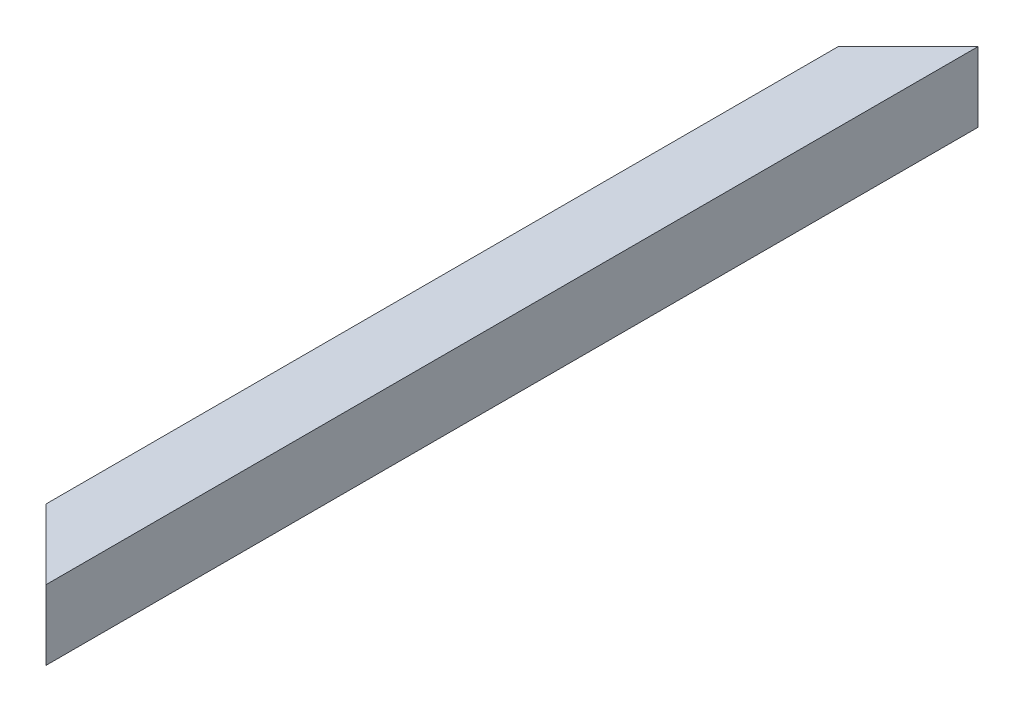
ISO-10303-21;
HEADER;
FILE_DESCRIPTION(('STEP AP214'),'2;1');
FILE_NAME('part.step','',(''),(''),'','','');
FILE_SCHEMA(('AUTOMOTIVE_DESIGN { 1 0 10303 214 1 1 1 1 }'));
ENDSEC;
DATA;
#1=APPLICATION_CONTEXT('core data for automotive mechanical design processes');
#2=APPLICATION_PROTOCOL_DEFINITION('international standard','automotive_design',2000,#1);
#3=PRODUCT_CONTEXT('',#1,'mechanical');
#4=PRODUCT('Part','Part','',(#3));
#5=PRODUCT_RELATED_PRODUCT_CATEGORY('part','',(#4));
#6=PRODUCT_DEFINITION_FORMATION('','',#4);
#7=PRODUCT_DEFINITION_CONTEXT('part definition',#1,'design');
#8=PRODUCT_DEFINITION('design','',#6,#7);
#9=PRODUCT_DEFINITION_SHAPE('','',#8);
#10=(LENGTH_UNIT() NAMED_UNIT(*) SI_UNIT(.MILLI.,.METRE.));
#11=(NAMED_UNIT(*) PLANE_ANGLE_UNIT() SI_UNIT($,.RADIAN.));
#12=(NAMED_UNIT(*) SI_UNIT($,.STERADIAN.) SOLID_ANGLE_UNIT());
#13=UNCERTAINTY_MEASURE_WITH_UNIT(LENGTH_MEASURE(1.E-05),#10,'distance_accuracy_value','');
#14=(GEOMETRIC_REPRESENTATION_CONTEXT(3) GLOBAL_UNCERTAINTY_ASSIGNED_CONTEXT((#13)) GLOBAL_UNIT_ASSIGNED_CONTEXT((#10,
#11,#12)) REPRESENTATION_CONTEXT('',''));
#15=CARTESIAN_POINT('',(0.,0.,0.));
#16=DIRECTION('',(0.,0.,1.));
#17=DIRECTION('',(1.,0.,0.));
#18=AXIS2_PLACEMENT_3D('',#15,#16,#17);
#19=CARTESIAN_POINT('',(-26.,26.,0.));
#20=DIRECTION('',(1.,0.,0.));
#21=DIRECTION('',(0.,0.,-1.));
#22=AXIS2_PLACEMENT_3D('',#19,#20,#21);
#23=PLANE('',#22);
#24=DIRECTION('',(0.,-1.,0.));
#25=VECTOR('',#24,1.);
#26=CARTESIAN_POINT('',(-26.,26.,55.9999999999994));
#27=LINE('',#26,#25);
#28=CARTESIAN_POINT('',(-26.,26.,55.9999999999994));
#29=VERTEX_POINT('',#28);
#30=CARTESIAN_POINT('',(-26.,-26.,55.9999999999994));
#31=VERTEX_POINT('',#30);
#32=EDGE_CURVE('E11',#29,#31,#27,.T.);
#33=ORIENTED_EDGE('',*,*,#32,.F.);
#34=DIRECTION('',(0.,0.,1.));
#35=VECTOR('',#34,1.);
#36=CARTESIAN_POINT('',(-26.,26.,0.));
#37=LINE('',#36,#35);
#38=CARTESIAN_POINT('',(-26.,26.,744.000000000001));
#39=VERTEX_POINT('',#38);
#40=EDGE_CURVE('E144',#29,#39,#37,.T.);
#41=ORIENTED_EDGE('',*,*,#40,.T.);
#42=DIRECTION('',(0.,1.,0.));
#43=VECTOR('',#42,1.);
#44=CARTESIAN_POINT('',(-26.,26.,744.000000000001));
#45=LINE('',#44,#43);
#46=CARTESIAN_POINT('',(-26.,-26.,744.000000000001));
#47=VERTEX_POINT('',#46);
#48=EDGE_CURVE('E42',#47,#39,#45,.T.);
#49=ORIENTED_EDGE('',*,*,#48,.F.);
#50=DIRECTION('',(0.,0.,1.));
#51=VECTOR('',#50,1.);
#52=CARTESIAN_POINT('',(-26.,-26.,0.));
#53=LINE('',#52,#51);
#54=EDGE_CURVE('E131',#31,#47,#53,.T.);
#55=ORIENTED_EDGE('',*,*,#54,.F.);
#56=EDGE_LOOP('',(#33,#41,#49,#55));
#57=FACE_BOUND('',#56,.T.);
#58=ADVANCED_FACE('F34',(#57),#23,.T.);
#59=CARTESIAN_POINT('',(-26.,-26.,0.));
#60=DIRECTION('',(0.,1.,0.));
#61=DIRECTION('',(0.,0.,1.));
#62=AXIS2_PLACEMENT_3D('',#59,#60,#61);
#63=PLANE('',#62);
#64=DIRECTION('',(0.707106781186551,0.,-0.707106781186544));
#65=VECTOR('',#64,1.);
#66=CARTESIAN_POINT('',(1.9999999999997,-26.,28.));
#67=LINE('',#66,#65);
#68=CARTESIAN_POINT('',(26.,-26.,3.99999999999995));
#69=VERTEX_POINT('',#68);
#70=EDGE_CURVE('E164',#31,#69,#67,.T.);
#71=ORIENTED_EDGE('',*,*,#70,.F.);
#72=ORIENTED_EDGE('',*,*,#54,.T.);
#73=DIRECTION('',(-0.707106781186551,0.,-0.707106781186544));
#74=VECTOR('',#73,1.);
#75=CARTESIAN_POINT('',(-398.,-26.,372.000000000004));
#76=LINE('',#75,#74);
#77=CARTESIAN_POINT('',(26.,-26.,796.));
#78=VERTEX_POINT('',#77);
#79=EDGE_CURVE('E56',#78,#47,#76,.T.);
#80=ORIENTED_EDGE('',*,*,#79,.F.);
#81=DIRECTION('',(0.,0.,1.));
#82=VECTOR('',#81,1.);
#83=CARTESIAN_POINT('',(26.,-26.,0.));
#84=LINE('',#83,#82);
#85=EDGE_CURVE('E134',#69,#78,#84,.T.);
#86=ORIENTED_EDGE('',*,*,#85,.F.);
#87=EDGE_LOOP('',(#71,#72,#80,#86));
#88=FACE_BOUND('',#87,.T.);
#89=ADVANCED_FACE('F180',(#88),#63,.T.);
#90=CARTESIAN_POINT('',(26.,26.,0.));
#91=DIRECTION('',(-1.,0.,0.));
#92=DIRECTION('',(0.,0.,1.));
#93=AXIS2_PLACEMENT_3D('',#90,#91,#92);
#94=PLANE('',#93);
#95=DIRECTION('',(0.,1.,0.));
#96=VECTOR('',#95,1.);
#97=CARTESIAN_POINT('',(26.,26.,3.99999999999995));
#98=LINE('',#97,#96);
#99=CARTESIAN_POINT('',(26.,26.,3.99999999999995));
#100=VERTEX_POINT('',#99);
#101=EDGE_CURVE('E166',#69,#100,#98,.T.);
#102=ORIENTED_EDGE('',*,*,#101,.F.);
#103=ORIENTED_EDGE('',*,*,#85,.T.);
#104=DIRECTION('',(0.,-1.,0.));
#105=VECTOR('',#104,1.);
#106=CARTESIAN_POINT('',(26.,26.,796.));
#107=LINE('',#106,#105);
#108=CARTESIAN_POINT('',(26.,26.,796.));
#109=VERTEX_POINT('',#108);
#110=EDGE_CURVE('E160',#109,#78,#107,.T.);
#111=ORIENTED_EDGE('',*,*,#110,.F.);
#112=DIRECTION('',(0.,0.,1.));
#113=VECTOR('',#112,1.);
#114=CARTESIAN_POINT('',(26.,26.,0.));
#115=LINE('',#114,#113);
#116=EDGE_CURVE('E140',#100,#109,#115,.T.);
#117=ORIENTED_EDGE('',*,*,#116,.F.);
#118=EDGE_LOOP('',(#102,#103,#111,#117));
#119=FACE_BOUND('',#118,.T.);
#120=ADVANCED_FACE('F177',(#119),#94,.T.);
#121=CARTESIAN_POINT('',(-26.,26.,0.));
#122=DIRECTION('',(0.,-1.,0.));
#123=DIRECTION('',(0.,0.,-1.));
#124=AXIS2_PLACEMENT_3D('',#121,#122,#123);
#125=PLANE('',#124);
#126=DIRECTION('',(-0.707106781186551,0.,0.707106781186544));
#127=VECTOR('',#126,1.);
#128=CARTESIAN_POINT('',(1.9999999999997,26.,28.));
#129=LINE('',#128,#127);
#130=EDGE_CURVE('E48',#100,#29,#129,.T.);
#131=ORIENTED_EDGE('',*,*,#130,.F.);
#132=ORIENTED_EDGE('',*,*,#116,.T.);
#133=DIRECTION('',(0.707106781186551,0.,0.707106781186544));
#134=VECTOR('',#133,1.);
#135=CARTESIAN_POINT('',(-398.,26.,372.000000000004));
#136=LINE('',#135,#134);
#137=EDGE_CURVE('E162',#39,#109,#136,.T.);
#138=ORIENTED_EDGE('',*,*,#137,.F.);
#139=ORIENTED_EDGE('',*,*,#40,.F.);
#140=EDGE_LOOP('',(#131,#132,#138,#139));
#141=FACE_BOUND('',#140,.T.);
#142=ADVANCED_FACE('F172',(#141),#125,.T.);
#143=CARTESIAN_POINT('',(30.,-30.,800.));
#144=DIRECTION('',(0.707106781186544,0.,-0.707106781186551));
#145=DIRECTION('',(-0.707106781186551,0.,-0.707106781186544));
#146=AXIS2_PLACEMENT_3D('',#143,#144,#145);
#147=PLANE('',#146);
#148=ORIENTED_EDGE('',*,*,#137,.T.);
#149=ORIENTED_EDGE('',*,*,#110,.T.);
#150=ORIENTED_EDGE('',*,*,#79,.T.);
#151=ORIENTED_EDGE('',*,*,#48,.T.);
#152=EDGE_LOOP('',(#148,#149,#150,#151));
#153=FACE_BOUND('',#152,.T.);
#154=DIRECTION('',(-0.707106781186551,0.,-0.707106781186544));
#155=VECTOR('',#154,1.);
#156=CARTESIAN_POINT('',(30.,30.,800.));
#157=LINE('',#156,#155);
#158=CARTESIAN_POINT('',(30.,30.,800.));
#159=VERTEX_POINT('',#158);
#160=CARTESIAN_POINT('',(-30.,30.,740.000000000001));
#161=VERTEX_POINT('',#160);
#162=EDGE_CURVE('E153',#159,#161,#157,.T.);
#163=ORIENTED_EDGE('',*,*,#162,.T.);
#164=DIRECTION('',(0.,1.,0.));
#165=VECTOR('',#164,1.);
#166=CARTESIAN_POINT('',(-30.,-30.,740.000000000001));
#167=LINE('',#166,#165);
#168=CARTESIAN_POINT('',(-30.,-30.,740.000000000001));
#169=VERTEX_POINT('',#168);
#170=EDGE_CURVE('E155',#169,#161,#167,.T.);
#171=ORIENTED_EDGE('',*,*,#170,.F.);
#172=DIRECTION('',(-0.707106781186551,0.,-0.707106781186544));
#173=VECTOR('',#172,1.);
#174=CARTESIAN_POINT('',(30.,-30.,800.));
#175=LINE('',#174,#173);
#176=CARTESIAN_POINT('',(30.,-30.,800.));
#177=VERTEX_POINT('',#176);
#178=EDGE_CURVE('E121',#177,#169,#175,.T.);
#179=ORIENTED_EDGE('',*,*,#178,.F.);
#180=DIRECTION('',(0.,1.,0.));
#181=VECTOR('',#180,1.);
#182=CARTESIAN_POINT('',(30.,30.,800.));
#183=LINE('',#182,#181);
#184=EDGE_CURVE('E143',#177,#159,#183,.T.);
#185=ORIENTED_EDGE('',*,*,#184,.T.);
#186=EDGE_LOOP('',(#163,#171,#179,#185));
#187=FACE_BOUND('',#186,.T.);
#188=ADVANCED_FACE('F179',(#153,#187),#147,.F.);
#189=CARTESIAN_POINT('',(30.,-30.,0.));
#190=DIRECTION('',(0.707106781186544,0.,0.707106781186551));
#191=DIRECTION('',(0.707106781186551,0.,-0.707106781186544));
#192=AXIS2_PLACEMENT_3D('',#189,#190,#191);
#193=PLANE('',#192);
#194=ORIENTED_EDGE('',*,*,#130,.T.);
#195=ORIENTED_EDGE('',*,*,#32,.T.);
#196=ORIENTED_EDGE('',*,*,#70,.T.);
#197=ORIENTED_EDGE('',*,*,#101,.T.);
#198=EDGE_LOOP('',(#194,#195,#196,#197));
#199=FACE_BOUND('',#198,.T.);
#200=DIRECTION('',(0.707106781186551,0.,-0.707106781186544));
#201=VECTOR('',#200,1.);
#202=CARTESIAN_POINT('',(30.,30.,0.));
#203=LINE('',#202,#201);
#204=CARTESIAN_POINT('',(-30.,30.,59.9999999999994));
#205=VERTEX_POINT('',#204);
#206=CARTESIAN_POINT('',(30.,30.,0.));
#207=VERTEX_POINT('',#206);
#208=EDGE_CURVE('E108',#205,#207,#203,.T.);
#209=ORIENTED_EDGE('',*,*,#208,.T.);
#210=DIRECTION('',(0.,1.,0.));
#211=VECTOR('',#210,1.);
#212=CARTESIAN_POINT('',(30.,30.,0.));
#213=LINE('',#212,#211);
#214=CARTESIAN_POINT('',(30.,-30.,0.));
#215=VERTEX_POINT('',#214);
#216=EDGE_CURVE('E103',#215,#207,#213,.T.);
#217=ORIENTED_EDGE('',*,*,#216,.F.);
#218=DIRECTION('',(0.707106781186551,0.,-0.707106781186544));
#219=VECTOR('',#218,1.);
#220=CARTESIAN_POINT('',(30.,-30.,0.));
#221=LINE('',#220,#219);
#222=CARTESIAN_POINT('',(-30.,-30.,59.9999999999994));
#223=VERTEX_POINT('',#222);
#224=EDGE_CURVE('E97',#223,#215,#221,.T.);
#225=ORIENTED_EDGE('',*,*,#224,.F.);
#226=DIRECTION('',(0.,1.,0.));
#227=VECTOR('',#226,1.);
#228=CARTESIAN_POINT('',(-30.,-30.,59.9999999999994));
#229=LINE('',#228,#227);
#230=EDGE_CURVE('E100',#223,#205,#229,.T.);
#231=ORIENTED_EDGE('',*,*,#230,.T.);
#232=EDGE_LOOP('',(#209,#217,#225,#231));
#233=FACE_BOUND('',#232,.T.);
#234=ADVANCED_FACE('F99',(#199,#233),#193,.F.);
#235=CARTESIAN_POINT('',(-30.,30.,0.));
#236=DIRECTION('',(-1.,0.,0.));
#237=DIRECTION('',(0.,0.,1.));
#238=AXIS2_PLACEMENT_3D('',#235,#236,#237);
#239=PLANE('',#238);
#240=ORIENTED_EDGE('',*,*,#230,.F.);
#241=DIRECTION('',(0.,0.,1.));
#242=VECTOR('',#241,1.);
#243=CARTESIAN_POINT('',(-30.,-30.,0.));
#244=LINE('',#243,#242);
#245=EDGE_CURVE('E115',#223,#169,#244,.T.);
#246=ORIENTED_EDGE('',*,*,#245,.T.);
#247=ORIENTED_EDGE('',*,*,#170,.T.);
#248=DIRECTION('',(0.,0.,1.));
#249=VECTOR('',#248,1.);
#250=CARTESIAN_POINT('',(-30.,30.,0.));
#251=LINE('',#250,#249);
#252=EDGE_CURVE('E117',#205,#161,#251,.T.);
#253=ORIENTED_EDGE('',*,*,#252,.F.);
#254=EDGE_LOOP('',(#240,#246,#247,#253));
#255=FACE_BOUND('',#254,.T.);
#256=ADVANCED_FACE('F113',(#255),#239,.T.);
#257=CARTESIAN_POINT('',(-30.,-30.,0.));
#258=DIRECTION('',(0.,-1.,0.));
#259=DIRECTION('',(0.,0.,-1.));
#260=AXIS2_PLACEMENT_3D('',#257,#258,#259);
#261=PLANE('',#260);
#262=ORIENTED_EDGE('',*,*,#224,.T.);
#263=DIRECTION('',(0.,0.,1.));
#264=VECTOR('',#263,1.);
#265=CARTESIAN_POINT('',(30.,-30.,0.));
#266=LINE('',#265,#264);
#267=EDGE_CURVE('E122',#215,#177,#266,.T.);
#268=ORIENTED_EDGE('',*,*,#267,.T.);
#269=ORIENTED_EDGE('',*,*,#178,.T.);
#270=ORIENTED_EDGE('',*,*,#245,.F.);
#271=EDGE_LOOP('',(#262,#268,#269,#270));
#272=FACE_BOUND('',#271,.T.);
#273=ADVANCED_FACE('F120',(#272),#261,.T.);
#274=CARTESIAN_POINT('',(30.,30.,0.));
#275=DIRECTION('',(1.,0.,0.));
#276=DIRECTION('',(0.,0.,-1.));
#277=AXIS2_PLACEMENT_3D('',#274,#275,#276);
#278=PLANE('',#277);
#279=DIRECTION('',(0.,0.,1.));
#280=VECTOR('',#279,1.);
#281=CARTESIAN_POINT('',(30.,30.,0.));
#282=LINE('',#281,#280);
#283=EDGE_CURVE('E124',#207,#159,#282,.T.);
#284=ORIENTED_EDGE('',*,*,#283,.T.);
#285=ORIENTED_EDGE('',*,*,#184,.F.);
#286=ORIENTED_EDGE('',*,*,#267,.F.);
#287=ORIENTED_EDGE('',*,*,#216,.T.);
#288=EDGE_LOOP('',(#284,#285,#286,#287));
#289=FACE_BOUND('',#288,.T.);
#290=ADVANCED_FACE('F151',(#289),#278,.T.);
#291=CARTESIAN_POINT('',(-30.,30.,0.));
#292=DIRECTION('',(0.,1.,0.));
#293=DIRECTION('',(0.,0.,1.));
#294=AXIS2_PLACEMENT_3D('',#291,#292,#293);
#295=PLANE('',#294);
#296=ORIENTED_EDGE('',*,*,#208,.F.);
#297=ORIENTED_EDGE('',*,*,#252,.T.);
#298=ORIENTED_EDGE('',*,*,#162,.F.);
#299=ORIENTED_EDGE('',*,*,#283,.F.);
#300=EDGE_LOOP('',(#296,#297,#298,#299));
#301=FACE_BOUND('',#300,.T.);
#302=ADVANCED_FACE('F36',(#301),#295,.T.);
#303=CLOSED_SHELL('',(#58,#89,#120,#142,#188,#234,#256,#273,#290,#302));
#304=MANIFOLD_SOLID_BREP('B2',#303);
#305=ADVANCED_BREP_SHAPE_REPRESENTATION('',(#18,#304),#14);
#306=SHAPE_DEFINITION_REPRESENTATION(#9,#305);
ENDSEC;
END-ISO-10303-21;
